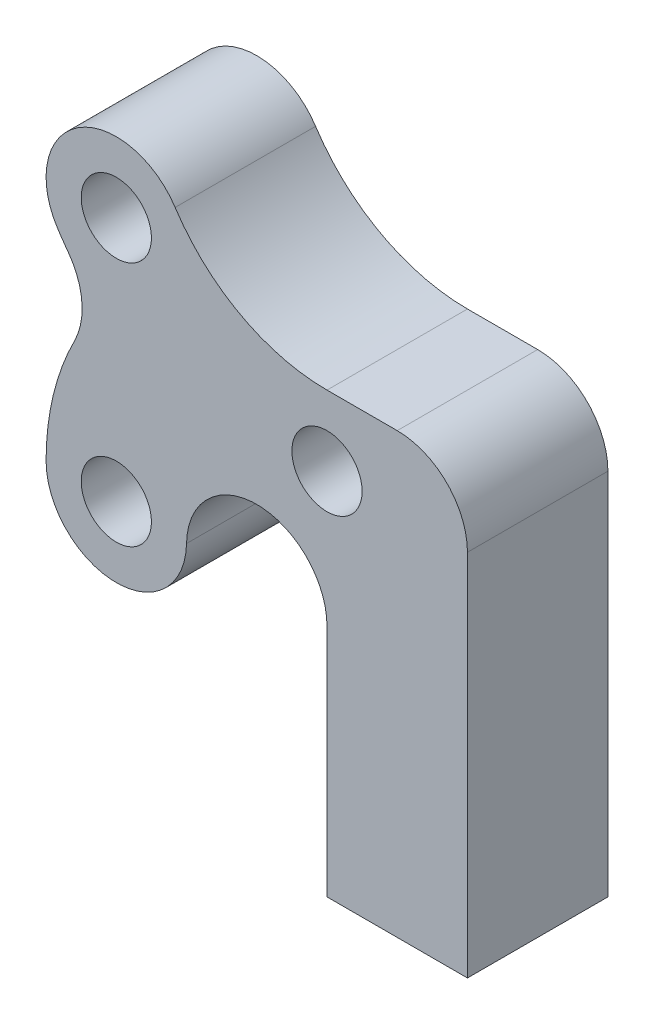
ISO-10303-21;
HEADER;
FILE_DESCRIPTION(('STEP AP214'),'2;1');
FILE_NAME('part.step','',(''),(''),'','','');
FILE_SCHEMA(('AUTOMOTIVE_DESIGN { 1 0 10303 214 1 1 1 1 }'));
ENDSEC;
DATA;
#1=APPLICATION_CONTEXT('core data for automotive mechanical design processes');
#2=APPLICATION_PROTOCOL_DEFINITION('international standard','automotive_design',2000,#1);
#3=PRODUCT_CONTEXT('',#1,'mechanical');
#4=PRODUCT('Part','Part','',(#3));
#5=PRODUCT_RELATED_PRODUCT_CATEGORY('part','',(#4));
#6=PRODUCT_DEFINITION_FORMATION('','',#4);
#7=PRODUCT_DEFINITION_CONTEXT('part definition',#1,'design');
#8=PRODUCT_DEFINITION('design','',#6,#7);
#9=PRODUCT_DEFINITION_SHAPE('','',#8);
#10=(LENGTH_UNIT() NAMED_UNIT(*) SI_UNIT(.MILLI.,.METRE.));
#11=(NAMED_UNIT(*) PLANE_ANGLE_UNIT() SI_UNIT($,.RADIAN.));
#12=(NAMED_UNIT(*) SI_UNIT($,.STERADIAN.) SOLID_ANGLE_UNIT());
#13=UNCERTAINTY_MEASURE_WITH_UNIT(LENGTH_MEASURE(1.E-05),#10,'distance_accuracy_value','');
#14=(GEOMETRIC_REPRESENTATION_CONTEXT(3) GLOBAL_UNCERTAINTY_ASSIGNED_CONTEXT((#13)) GLOBAL_UNIT_ASSIGNED_CONTEXT((#10,
#11,#12)) REPRESENTATION_CONTEXT('',''));
#15=CARTESIAN_POINT('',(0.,0.,0.));
#16=DIRECTION('',(0.,0.,1.));
#17=DIRECTION('',(1.,0.,0.));
#18=AXIS2_PLACEMENT_3D('',#15,#16,#17);
#19=CARTESIAN_POINT('',(5.63980747253201,-9.22937471019449,8.));
#20=DIRECTION('',(0.,0.,-1.));
#21=DIRECTION('',(-1.,0.,0.));
#22=AXIS2_PLACEMENT_3D('',#19,#20,#21);
#23=PLANE('',#22);
#24=DIRECTION('',(0.,1.,0.));
#25=VECTOR('',#24,1.);
#26=CARTESIAN_POINT('',(14.8236720319781,-22.7293747101943,8.));
#27=LINE('',#26,#25);
#28=CARTESIAN_POINT('',(14.8236720319781,-22.7293747101943,8.));
#29=VERTEX_POINT('',#28);
#30=CARTESIAN_POINT('',(14.8236720319781,-1.72937471019429,8.));
#31=VERTEX_POINT('',#30);
#32=EDGE_CURVE('E274',#29,#31,#27,.T.);
#33=ORIENTED_EDGE('',*,*,#32,.T.);
#34=CARTESIAN_POINT('',(10.8236720319781,-1.72937471019429,8.));
#35=DIRECTION('',(0.,0.,-1.));
#36=DIRECTION('',(-1.,0.,0.));
#37=AXIS2_PLACEMENT_3D('',#34,#35,#36);
#38=CIRCLE('',#37,4.);
#39=CARTESIAN_POINT('',(10.8236720319781,2.27062528980571,8.));
#40=VERTEX_POINT('',#39);
#41=EDGE_CURVE('E334',#31,#40,#38,.F.);
#42=ORIENTED_EDGE('',*,*,#41,.T.);
#43=DIRECTION('',(-1.,0.,0.));
#44=VECTOR('',#43,1.);
#45=CARTESIAN_POINT('',(14.8236720319781,2.27062528980571,8.));
#46=LINE('',#45,#44);
#47=CARTESIAN_POINT('',(6.82367203197809,2.2706252898057,8.));
#48=VERTEX_POINT('',#47);
#49=EDGE_CURVE('E276',#40,#48,#46,.T.);
#50=ORIENTED_EDGE('',*,*,#49,.T.);
#51=CARTESIAN_POINT('',(6.82367203197822,12.597548366729,8.));
#52=DIRECTION('',(0.,0.,1.));
#53=DIRECTION('',(1.,0.,0.));
#54=AXIS2_PLACEMENT_3D('',#51,#52,#53);
#55=CIRCLE('',#54,10.3269230769233);
#56=CARTESIAN_POINT('',(-1.82599239755211,6.95586018913457,8.));
#57=VERTEX_POINT('',#56);
#58=EDGE_CURVE('E281',#57,#48,#55,.T.);
#59=ORIENTED_EDGE('',*,*,#58,.F.);
#60=CARTESIAN_POINT('',(-5.17632796802191,4.77062528980571,8.));
#61=DIRECTION('',(0.,0.,1.));
#62=DIRECTION('',(1.,0.,0.));
#63=AXIS2_PLACEMENT_3D('',#60,#61,#62);
#64=CIRCLE('',#63,4.);
#65=CARTESIAN_POINT('',(-8.52666353849171,2.58539039047685,8.));
#66=VERTEX_POINT('',#65);
#67=EDGE_CURVE('E284',#57,#66,#64,.T.);
#68=ORIENTED_EDGE('',*,*,#67,.T.);
#69=CARTESIAN_POINT('',(6.8236720319781,12.5975483667288,8.));
#70=DIRECTION('',(0.,0.,1.));
#71=DIRECTION('',(1.,0.,0.));
#72=AXIS2_PLACEMENT_3D('',#69,#70,#71);
#73=CIRCLE('',#72,18.3269230769231);
#74=CARTESIAN_POINT('',(-7.90829225974873,1.69592749757627,8.));
#75=VERTEX_POINT('',#74);
#76=EDGE_CURVE('E286',#66,#75,#73,.T.);
#77=ORIENTED_EDGE('',*,*,#76,.T.);
#78=CARTESIAN_POINT('',(-11.1236632699053,-0.68343991143079,8.));
#79=DIRECTION('',(0.,0.,-1.));
#80=DIRECTION('',(-1.,0.,0.));
#81=AXIS2_PLACEMENT_3D('',#78,#79,#80);
#82=CIRCLE('',#81,4.);
#83=CARTESIAN_POINT('',(-7.5600259235653,-2.50016467423089,8.));
#84=VERTEX_POINT('',#83);
#85=EDGE_CURVE('E169',#75,#84,#82,.T.);
#86=ORIENTED_EDGE('',*,*,#85,.T.);
#87=CARTESIAN_POINT('',(5.63980747253156,-9.22937471019429,8.));
#88=DIRECTION('',(0.,0.,1.));
#89=DIRECTION('',(1.,0.,0.));
#90=AXIS2_PLACEMENT_3D('',#87,#88,#89);
#91=CIRCLE('',#90,14.8161354405535);
#92=CARTESIAN_POINT('',(-9.17632796802191,-9.22937471019429,8.));
#93=VERTEX_POINT('',#92);
#94=EDGE_CURVE('E288',#84,#93,#91,.T.);
#95=ORIENTED_EDGE('',*,*,#94,.T.);
#96=CARTESIAN_POINT('',(-5.17632796802191,-9.22937471019429,8.));
#97=DIRECTION('',(0.,0.,1.));
#98=DIRECTION('',(1.,0.,0.));
#99=AXIS2_PLACEMENT_3D('',#96,#97,#98);
#100=CIRCLE('',#99,4.);
#101=CARTESIAN_POINT('',(-1.17692786888462,-9.29864842108563,8.));
#102=VERTEX_POINT('',#101);
#103=EDGE_CURVE('E290',#93,#102,#100,.T.);
#104=ORIENTED_EDGE('',*,*,#103,.T.);
#105=CARTESIAN_POINT('',(2.82247223025266,-9.36792213197697,8.));
#106=DIRECTION('',(0.,0.,-1.));
#107=DIRECTION('',(-1.,0.,0.));
#108=AXIS2_PLACEMENT_3D('',#105,#106,#107);
#109=CIRCLE('',#108,4.);
#110=CARTESIAN_POINT('',(3.53931078215524,-5.43267849396595,8.));
#111=VERTEX_POINT('',#110);
#112=EDGE_CURVE('E354',#102,#111,#109,.T.);
#113=ORIENTED_EDGE('',*,*,#112,.T.);
#114=CARTESIAN_POINT('',(6.82367203197809,12.5975483667288,8.));
#115=DIRECTION('',(0.,0.,1.));
#116=DIRECTION('',(1.,0.,0.));
#117=AXIS2_PLACEMENT_3D('',#114,#115,#116);
#118=CIRCLE('',#117,18.3269230769231);
#119=CARTESIAN_POINT('',(3.54029563232262,-5.43285786512415,8.));
#120=VERTEX_POINT('',#119);
#121=EDGE_CURVE('E259',#111,#120,#118,.T.);
#122=ORIENTED_EDGE('',*,*,#121,.T.);
#123=CARTESIAN_POINT('',(2.82367203197809,-9.36814065234914,8.));
#124=DIRECTION('',(0.,0.,-1.));
#125=DIRECTION('',(-1.,0.,0.));
#126=AXIS2_PLACEMENT_3D('',#123,#124,#125);
#127=CIRCLE('',#126,4.);
#128=CARTESIAN_POINT('',(6.82367203197809,-9.36814065234914,8.));
#129=VERTEX_POINT('',#128);
#130=EDGE_CURVE('E12',#120,#129,#127,.T.);
#131=ORIENTED_EDGE('',*,*,#130,.T.);
#132=DIRECTION('',(0.,-1.,0.));
#133=VECTOR('',#132,1.);
#134=CARTESIAN_POINT('',(6.8236720319781,-5.7293747101943,8.));
#135=LINE('',#134,#133);
#136=CARTESIAN_POINT('',(6.82367203197809,-22.7293747101943,8.));
#137=VERTEX_POINT('',#136);
#138=EDGE_CURVE('E248',#129,#137,#135,.T.);
#139=ORIENTED_EDGE('',*,*,#138,.T.);
#140=DIRECTION('',(-1.,0.,0.));
#141=VECTOR('',#140,1.);
#142=CARTESIAN_POINT('',(14.8236720319781,-22.7293747101943,8.));
#143=LINE('',#142,#141);
#144=EDGE_CURVE('E253',#29,#137,#143,.T.);
#145=ORIENTED_EDGE('',*,*,#144,.F.);
#146=EDGE_LOOP('',(#33,#42,#50,#59,#68,#77,#86,#95,#104,#113,#122,#131,#139,#145));
#147=FACE_BOUND('',#146,.T.);
#148=CARTESIAN_POINT('',(-5.17632796802191,-9.22937471019429,8.));
#149=DIRECTION('',(0.,0.,1.));
#150=DIRECTION('',(1.,0.,0.));
#151=AXIS2_PLACEMENT_3D('',#148,#149,#150);
#152=CIRCLE('',#151,2.);
#153=CARTESIAN_POINT('',(-3.17632796802191,-9.22937471019429,8.));
#154=VERTEX_POINT('',#153);
#155=EDGE_CURVE('E296',#154,#154,#152,.T.);
#156=ORIENTED_EDGE('',*,*,#155,.F.);
#157=EDGE_LOOP('',(#156));
#158=FACE_BOUND('',#157,.T.);
#159=CARTESIAN_POINT('',(6.82367203197809,-1.72937471019429,8.));
#160=DIRECTION('',(0.,0.,1.));
#161=DIRECTION('',(1.,0.,0.));
#162=AXIS2_PLACEMENT_3D('',#159,#160,#161);
#163=CIRCLE('',#162,2.);
#164=CARTESIAN_POINT('',(8.82367203197809,-1.72937471019429,8.));
#165=VERTEX_POINT('',#164);
#166=EDGE_CURVE('E438',#165,#165,#163,.T.);
#167=ORIENTED_EDGE('',*,*,#166,.F.);
#168=EDGE_LOOP('',(#167));
#169=FACE_BOUND('',#168,.T.);
#170=CARTESIAN_POINT('',(-5.17632796802191,4.77062528980571,8.));
#171=DIRECTION('',(0.,0.,1.));
#172=DIRECTION('',(1.,0.,0.));
#173=AXIS2_PLACEMENT_3D('',#170,#171,#172);
#174=CIRCLE('',#173,2.);
#175=CARTESIAN_POINT('',(-3.17632796802191,4.77062528980571,8.));
#176=VERTEX_POINT('',#175);
#177=EDGE_CURVE('E444',#176,#176,#174,.T.);
#178=ORIENTED_EDGE('',*,*,#177,.F.);
#179=EDGE_LOOP('',(#178));
#180=FACE_BOUND('',#179,.T.);
#181=ADVANCED_FACE('F146',(#147,#158,#169,#180),#23,.F.);
#182=CARTESIAN_POINT('',(5.63980747253201,-9.22937471019449,0.));
#183=DIRECTION('',(0.,0.,-1.));
#184=DIRECTION('',(-1.,0.,0.));
#185=AXIS2_PLACEMENT_3D('',#182,#183,#184);
#186=PLANE('',#185);
#187=CARTESIAN_POINT('',(6.82367203197809,-1.72937471019429,0.));
#188=DIRECTION('',(0.,0.,1.));
#189=DIRECTION('',(1.,0.,0.));
#190=AXIS2_PLACEMENT_3D('',#187,#188,#189);
#191=CIRCLE('',#190,2.);
#192=CARTESIAN_POINT('',(8.82367203197809,-1.72937471019429,0.));
#193=VERTEX_POINT('',#192);
#194=EDGE_CURVE('E441',#193,#193,#191,.T.);
#195=ORIENTED_EDGE('',*,*,#194,.T.);
#196=EDGE_LOOP('',(#195));
#197=FACE_BOUND('',#196,.T.);
#198=DIRECTION('',(-1.,0.,0.));
#199=VECTOR('',#198,1.);
#200=CARTESIAN_POINT('',(14.8236720319781,2.27062528980571,0.));
#201=LINE('',#200,#199);
#202=CARTESIAN_POINT('',(10.8236720319781,2.27062528980571,0.));
#203=VERTEX_POINT('',#202);
#204=CARTESIAN_POINT('',(6.82367203197809,2.2706252898057,0.));
#205=VERTEX_POINT('',#204);
#206=EDGE_CURVE('E303',#203,#205,#201,.T.);
#207=ORIENTED_EDGE('',*,*,#206,.F.);
#208=CARTESIAN_POINT('',(10.8236720319781,-1.72937471019429,0.));
#209=DIRECTION('',(0.,0.,-1.));
#210=DIRECTION('',(-1.,0.,0.));
#211=AXIS2_PLACEMENT_3D('',#208,#209,#210);
#212=CIRCLE('',#211,4.);
#213=CARTESIAN_POINT('',(14.8236720319781,-1.72937471019429,0.));
#214=VERTEX_POINT('',#213);
#215=EDGE_CURVE('E330',#203,#214,#212,.T.);
#216=ORIENTED_EDGE('',*,*,#215,.T.);
#217=DIRECTION('',(0.,1.,0.));
#218=VECTOR('',#217,1.);
#219=CARTESIAN_POINT('',(14.8236720319781,-22.7293747101943,0.));
#220=LINE('',#219,#218);
#221=CARTESIAN_POINT('',(14.8236720319781,-22.7293747101943,0.));
#222=VERTEX_POINT('',#221);
#223=EDGE_CURVE('E300',#222,#214,#220,.T.);
#224=ORIENTED_EDGE('',*,*,#223,.F.);
#225=DIRECTION('',(-1.,0.,0.));
#226=VECTOR('',#225,1.);
#227=CARTESIAN_POINT('',(14.8236720319781,-22.7293747101943,0.));
#228=LINE('',#227,#226);
#229=CARTESIAN_POINT('',(6.82367203197809,-22.7293747101943,0.));
#230=VERTEX_POINT('',#229);
#231=EDGE_CURVE('E298',#222,#230,#228,.T.);
#232=ORIENTED_EDGE('',*,*,#231,.T.);
#233=DIRECTION('',(0.,-1.,0.));
#234=VECTOR('',#233,1.);
#235=CARTESIAN_POINT('',(6.8236720319781,-5.7293747101943,0.));
#236=LINE('',#235,#234);
#237=CARTESIAN_POINT('',(6.82367203197809,-9.36814065234914,0.));
#238=VERTEX_POINT('',#237);
#239=EDGE_CURVE('E265',#238,#230,#236,.T.);
#240=ORIENTED_EDGE('',*,*,#239,.F.);
#241=CARTESIAN_POINT('',(2.82367203197809,-9.36814065234914,0.));
#242=DIRECTION('',(0.,0.,-1.));
#243=DIRECTION('',(-1.,0.,0.));
#244=AXIS2_PLACEMENT_3D('',#241,#242,#243);
#245=CIRCLE('',#244,4.);
#246=CARTESIAN_POINT('',(3.54029563232262,-5.43285786512415,0.));
#247=VERTEX_POINT('',#246);
#248=EDGE_CURVE('E154',#238,#247,#245,.F.);
#249=ORIENTED_EDGE('',*,*,#248,.T.);
#250=CARTESIAN_POINT('',(6.82367203197809,12.5975483667288,0.));
#251=DIRECTION('',(0.,0.,1.));
#252=DIRECTION('',(1.,0.,0.));
#253=AXIS2_PLACEMENT_3D('',#250,#251,#252);
#254=CIRCLE('',#253,18.3269230769231);
#255=CARTESIAN_POINT('',(3.53931078215524,-5.43267849396595,0.));
#256=VERTEX_POINT('',#255);
#257=EDGE_CURVE('E293',#256,#247,#254,.T.);
#258=ORIENTED_EDGE('',*,*,#257,.F.);
#259=CARTESIAN_POINT('',(2.82247223025266,-9.36792213197697,0.));
#260=DIRECTION('',(0.,0.,-1.));
#261=DIRECTION('',(-1.,0.,0.));
#262=AXIS2_PLACEMENT_3D('',#259,#260,#261);
#263=CIRCLE('',#262,4.);
#264=CARTESIAN_POINT('',(-1.17692786888462,-9.29864842108563,0.));
#265=VERTEX_POINT('',#264);
#266=EDGE_CURVE('E352',#256,#265,#263,.F.);
#267=ORIENTED_EDGE('',*,*,#266,.T.);
#268=CARTESIAN_POINT('',(-5.17632796802191,-9.22937471019429,0.));
#269=DIRECTION('',(0.,0.,1.));
#270=DIRECTION('',(1.,0.,0.));
#271=AXIS2_PLACEMENT_3D('',#268,#269,#270);
#272=CIRCLE('',#271,4.);
#273=CARTESIAN_POINT('',(-9.17632796802191,-9.22937471019429,0.));
#274=VERTEX_POINT('',#273);
#275=EDGE_CURVE('E315',#274,#265,#272,.T.);
#276=ORIENTED_EDGE('',*,*,#275,.F.);
#277=CARTESIAN_POINT('',(5.63980747253156,-9.22937471019429,0.));
#278=DIRECTION('',(0.,0.,1.));
#279=DIRECTION('',(1.,0.,0.));
#280=AXIS2_PLACEMENT_3D('',#277,#278,#279);
#281=CIRCLE('',#280,14.8161354405535);
#282=CARTESIAN_POINT('',(-7.5600259235653,-2.50016467423089,0.));
#283=VERTEX_POINT('',#282);
#284=EDGE_CURVE('E313',#283,#274,#281,.T.);
#285=ORIENTED_EDGE('',*,*,#284,.F.);
#286=CARTESIAN_POINT('',(-11.1236632699053,-0.68343991143079,0.));
#287=DIRECTION('',(0.,0.,-1.));
#288=DIRECTION('',(-1.,0.,0.));
#289=AXIS2_PLACEMENT_3D('',#286,#287,#288);
#290=CIRCLE('',#289,4.);
#291=CARTESIAN_POINT('',(-7.90829225974873,1.69592749757627,0.));
#292=VERTEX_POINT('',#291);
#293=EDGE_CURVE('E349',#283,#292,#290,.F.);
#294=ORIENTED_EDGE('',*,*,#293,.T.);
#295=CARTESIAN_POINT('',(6.8236720319781,12.5975483667288,0.));
#296=DIRECTION('',(0.,0.,1.));
#297=DIRECTION('',(1.,0.,0.));
#298=AXIS2_PLACEMENT_3D('',#295,#296,#297);
#299=CIRCLE('',#298,18.3269230769231);
#300=CARTESIAN_POINT('',(-8.52666353849171,2.58539039047685,0.));
#301=VERTEX_POINT('',#300);
#302=EDGE_CURVE('E310',#301,#292,#299,.T.);
#303=ORIENTED_EDGE('',*,*,#302,.F.);
#304=CARTESIAN_POINT('',(-5.17632796802191,4.77062528980571,0.));
#305=DIRECTION('',(0.,0.,1.));
#306=DIRECTION('',(1.,0.,0.));
#307=AXIS2_PLACEMENT_3D('',#304,#305,#306);
#308=CIRCLE('',#307,4.);
#309=CARTESIAN_POINT('',(-1.82599239755211,6.95586018913457,0.));
#310=VERTEX_POINT('',#309);
#311=EDGE_CURVE('E308',#310,#301,#308,.T.);
#312=ORIENTED_EDGE('',*,*,#311,.F.);
#313=CARTESIAN_POINT('',(6.82367203197822,12.597548366729,0.));
#314=DIRECTION('',(0.,0.,1.));
#315=DIRECTION('',(1.,0.,0.));
#316=AXIS2_PLACEMENT_3D('',#313,#314,#315);
#317=CIRCLE('',#316,10.3269230769233);
#318=EDGE_CURVE('E305',#310,#205,#317,.T.);
#319=ORIENTED_EDGE('',*,*,#318,.T.);
#320=EDGE_LOOP('',(#207,#216,#224,#232,#240,#249,#258,#267,#276,#285,#294,#303,#312,#319));
#321=FACE_BOUND('',#320,.T.);
#322=CARTESIAN_POINT('',(-5.17632796802191,-9.22937471019429,0.));
#323=DIRECTION('',(0.,0.,1.));
#324=DIRECTION('',(1.,0.,0.));
#325=AXIS2_PLACEMENT_3D('',#322,#323,#324);
#326=CIRCLE('',#325,2.);
#327=CARTESIAN_POINT('',(-3.17632796802191,-9.22937471019429,0.));
#328=VERTEX_POINT('',#327);
#329=EDGE_CURVE('E435',#328,#328,#326,.T.);
#330=ORIENTED_EDGE('',*,*,#329,.T.);
#331=EDGE_LOOP('',(#330));
#332=FACE_BOUND('',#331,.T.);
#333=CARTESIAN_POINT('',(-5.17632796802191,4.77062528980571,0.));
#334=DIRECTION('',(0.,0.,1.));
#335=DIRECTION('',(1.,0.,0.));
#336=AXIS2_PLACEMENT_3D('',#333,#334,#335);
#337=CIRCLE('',#336,2.);
#338=CARTESIAN_POINT('',(-3.17632796802191,4.77062528980571,0.));
#339=VERTEX_POINT('',#338);
#340=EDGE_CURVE('E447',#339,#339,#337,.T.);
#341=ORIENTED_EDGE('',*,*,#340,.T.);
#342=EDGE_LOOP('',(#341));
#343=FACE_BOUND('',#342,.T.);
#344=ADVANCED_FACE('F358',(#197,#321,#332,#343),#186,.T.);
#345=CARTESIAN_POINT('',(6.82367203197809,12.5975483667288,8.));
#346=DIRECTION('',(0.,0.,-1.));
#347=DIRECTION('',(-1.,0.,0.));
#348=AXIS2_PLACEMENT_3D('',#345,#346,#347);
#349=CYLINDRICAL_SURFACE('',#348,18.3269230769231);
#350=ORIENTED_EDGE('',*,*,#121,.F.);
#351=DIRECTION('',(0.,0.,-1.));
#352=VECTOR('',#351,1.);
#353=CARTESIAN_POINT('',(3.53931078215524,-5.43267849396595,8.));
#354=LINE('',#353,#352);
#355=EDGE_CURVE('E343',#111,#256,#354,.T.);
#356=ORIENTED_EDGE('',*,*,#355,.T.);
#357=ORIENTED_EDGE('',*,*,#257,.T.);
#358=DIRECTION('',(0.,0.,-1.));
#359=VECTOR('',#358,1.);
#360=CARTESIAN_POINT('',(3.54029563232262,-5.43285786512415,8.));
#361=LINE('',#360,#359);
#362=EDGE_CURVE('E341',#247,#120,#361,.F.);
#363=ORIENTED_EDGE('',*,*,#362,.T.);
#364=EDGE_LOOP('',(#350,#356,#357,#363));
#365=FACE_BOUND('',#364,.T.);
#366=ADVANCED_FACE('F364',(#365),#349,.T.);
#367=CARTESIAN_POINT('',(6.8236720319781,-5.7293747101943,8.));
#368=DIRECTION('',(1.,0.,0.));
#369=DIRECTION('',(0.,1.,0.));
#370=AXIS2_PLACEMENT_3D('',#367,#368,#369);
#371=PLANE('',#370);
#372=ORIENTED_EDGE('',*,*,#138,.F.);
#373=DIRECTION('',(0.,0.,1.));
#374=VECTOR('',#373,1.);
#375=CARTESIAN_POINT('',(6.82367203197809,-9.36814065234914,0.));
#376=LINE('',#375,#374);
#377=EDGE_CURVE('E347',#129,#238,#376,.F.);
#378=ORIENTED_EDGE('',*,*,#377,.T.);
#379=ORIENTED_EDGE('',*,*,#239,.T.);
#380=DIRECTION('',(0.,0.,-1.));
#381=VECTOR('',#380,1.);
#382=CARTESIAN_POINT('',(6.82367203197809,-22.7293747101943,8.));
#383=LINE('',#382,#381);
#384=EDGE_CURVE('E262',#137,#230,#383,.T.);
#385=ORIENTED_EDGE('',*,*,#384,.F.);
#386=EDGE_LOOP('',(#372,#378,#379,#385));
#387=FACE_BOUND('',#386,.T.);
#388=ADVANCED_FACE('F263',(#387),#371,.F.);
#389=CARTESIAN_POINT('',(14.8236720319781,-22.7293747101943,8.));
#390=DIRECTION('',(0.,-1.,0.));
#391=DIRECTION('',(1.,0.,0.));
#392=AXIS2_PLACEMENT_3D('',#389,#390,#391);
#393=PLANE('',#392);
#394=CARTESIAN_POINT('',(10.8236720319781,-22.7293747101943,4.));
#395=DIRECTION('',(0.,-1.,0.));
#396=DIRECTION('',(0.,0.,-1.));
#397=AXIS2_PLACEMENT_3D('',#394,#395,#396);
#398=CIRCLE('',#397,2.);
#399=CARTESIAN_POINT('',(10.8236720319781,-22.7293747101943,2.));
#400=VERTEX_POINT('',#399);
#401=EDGE_CURVE('E453',#400,#400,#398,.T.);
#402=ORIENTED_EDGE('',*,*,#401,.F.);
#403=EDGE_LOOP('',(#402));
#404=FACE_BOUND('',#403,.T.);
#405=ORIENTED_EDGE('',*,*,#231,.F.);
#406=DIRECTION('',(0.,0.,-1.));
#407=VECTOR('',#406,1.);
#408=CARTESIAN_POINT('',(14.8236720319781,-22.7293747101943,8.));
#409=LINE('',#408,#407);
#410=EDGE_CURVE('E270',#29,#222,#409,.T.);
#411=ORIENTED_EDGE('',*,*,#410,.F.);
#412=ORIENTED_EDGE('',*,*,#144,.T.);
#413=ORIENTED_EDGE('',*,*,#384,.T.);
#414=EDGE_LOOP('',(#405,#411,#412,#413));
#415=FACE_BOUND('',#414,.T.);
#416=ADVANCED_FACE('F272',(#404,#415),#393,.T.);
#417=CARTESIAN_POINT('',(14.8236720319781,-22.7293747101943,8.));
#418=DIRECTION('',(-1.,0.,0.));
#419=DIRECTION('',(0.,-1.,0.));
#420=AXIS2_PLACEMENT_3D('',#417,#418,#419);
#421=PLANE('',#420);
#422=ORIENTED_EDGE('',*,*,#223,.T.);
#423=DIRECTION('',(0.,0.,-1.));
#424=VECTOR('',#423,1.);
#425=CARTESIAN_POINT('',(14.8236720319781,-1.72937471019429,8.));
#426=LINE('',#425,#424);
#427=EDGE_CURVE('E332',#214,#31,#426,.F.);
#428=ORIENTED_EDGE('',*,*,#427,.T.);
#429=ORIENTED_EDGE('',*,*,#32,.F.);
#430=ORIENTED_EDGE('',*,*,#410,.T.);
#431=EDGE_LOOP('',(#422,#428,#429,#430));
#432=FACE_BOUND('',#431,.T.);
#433=ADVANCED_FACE('F406',(#432),#421,.F.);
#434=CARTESIAN_POINT('',(14.8236720319781,2.27062528980571,8.));
#435=DIRECTION('',(0.,-1.,0.));
#436=DIRECTION('',(1.,0.,0.));
#437=AXIS2_PLACEMENT_3D('',#434,#435,#436);
#438=PLANE('',#437);
#439=ORIENTED_EDGE('',*,*,#49,.F.);
#440=DIRECTION('',(0.,0.,-1.));
#441=VECTOR('',#440,1.);
#442=CARTESIAN_POINT('',(10.8236720319781,2.27062528980571,8.));
#443=LINE('',#442,#441);
#444=EDGE_CURVE('E269',#40,#203,#443,.T.);
#445=ORIENTED_EDGE('',*,*,#444,.T.);
#446=ORIENTED_EDGE('',*,*,#206,.T.);
#447=DIRECTION('',(0.,0.,-1.));
#448=VECTOR('',#447,1.);
#449=CARTESIAN_POINT('',(6.82367203197809,2.2706252898057,8.));
#450=LINE('',#449,#448);
#451=EDGE_CURVE('E324',#48,#205,#450,.T.);
#452=ORIENTED_EDGE('',*,*,#451,.F.);
#453=EDGE_LOOP('',(#439,#445,#446,#452));
#454=FACE_BOUND('',#453,.T.);
#455=ADVANCED_FACE('F402',(#454),#438,.F.);
#456=CARTESIAN_POINT('',(6.82367203197822,12.597548366729,8.));
#457=DIRECTION('',(0.,0.,-1.));
#458=DIRECTION('',(-1.,0.,0.));
#459=AXIS2_PLACEMENT_3D('',#456,#457,#458);
#460=CYLINDRICAL_SURFACE('',#459,10.3269230769233);
#461=ORIENTED_EDGE('',*,*,#318,.F.);
#462=DIRECTION('',(0.,0.,-1.));
#463=VECTOR('',#462,1.);
#464=CARTESIAN_POINT('',(-1.82599239755211,6.95586018913457,8.));
#465=LINE('',#464,#463);
#466=EDGE_CURVE('E322',#57,#310,#465,.T.);
#467=ORIENTED_EDGE('',*,*,#466,.F.);
#468=ORIENTED_EDGE('',*,*,#58,.T.);
#469=ORIENTED_EDGE('',*,*,#451,.T.);
#470=EDGE_LOOP('',(#461,#467,#468,#469));
#471=FACE_BOUND('',#470,.T.);
#472=ADVANCED_FACE('F398',(#471),#460,.F.);
#473=CARTESIAN_POINT('',(-5.17632796802191,4.77062528980571,8.));
#474=DIRECTION('',(0.,0.,-1.));
#475=DIRECTION('',(-1.,0.,0.));
#476=AXIS2_PLACEMENT_3D('',#473,#474,#475);
#477=CYLINDRICAL_SURFACE('',#476,4.);
#478=ORIENTED_EDGE('',*,*,#311,.T.);
#479=DIRECTION('',(0.,0.,-1.));
#480=VECTOR('',#479,1.);
#481=CARTESIAN_POINT('',(-8.52666353849171,2.58539039047685,8.));
#482=LINE('',#481,#480);
#483=EDGE_CURVE('E319',#66,#301,#482,.T.);
#484=ORIENTED_EDGE('',*,*,#483,.F.);
#485=ORIENTED_EDGE('',*,*,#67,.F.);
#486=ORIENTED_EDGE('',*,*,#466,.T.);
#487=EDGE_LOOP('',(#478,#484,#485,#486));
#488=FACE_BOUND('',#487,.T.);
#489=ADVANCED_FACE('F394',(#488),#477,.T.);
#490=CARTESIAN_POINT('',(6.8236720319781,12.5975483667288,8.));
#491=DIRECTION('',(0.,0.,-1.));
#492=DIRECTION('',(-1.,0.,0.));
#493=AXIS2_PLACEMENT_3D('',#490,#491,#492);
#494=CYLINDRICAL_SURFACE('',#493,18.3269230769231);
#495=ORIENTED_EDGE('',*,*,#302,.T.);
#496=DIRECTION('',(0.,0.,-1.));
#497=VECTOR('',#496,1.);
#498=CARTESIAN_POINT('',(-7.90829225974873,1.69592749757627,8.));
#499=LINE('',#498,#497);
#500=EDGE_CURVE('E339',#292,#75,#499,.F.);
#501=ORIENTED_EDGE('',*,*,#500,.T.);
#502=ORIENTED_EDGE('',*,*,#76,.F.);
#503=ORIENTED_EDGE('',*,*,#483,.T.);
#504=EDGE_LOOP('',(#495,#501,#502,#503));
#505=FACE_BOUND('',#504,.T.);
#506=ADVANCED_FACE('F390',(#505),#494,.T.);
#507=CARTESIAN_POINT('',(5.63980747253156,-9.22937471019429,8.));
#508=DIRECTION('',(0.,0.,-1.));
#509=DIRECTION('',(-1.,0.,0.));
#510=AXIS2_PLACEMENT_3D('',#507,#508,#509);
#511=CYLINDRICAL_SURFACE('',#510,14.8161354405535);
#512=ORIENTED_EDGE('',*,*,#94,.F.);
#513=DIRECTION('',(0.,0.,-1.));
#514=VECTOR('',#513,1.);
#515=CARTESIAN_POINT('',(-7.5600259235653,-2.50016467423089,8.));
#516=LINE('',#515,#514);
#517=EDGE_CURVE('E336',#84,#283,#516,.T.);
#518=ORIENTED_EDGE('',*,*,#517,.T.);
#519=ORIENTED_EDGE('',*,*,#284,.T.);
#520=DIRECTION('',(0.,0.,-1.));
#521=VECTOR('',#520,1.);
#522=CARTESIAN_POINT('',(-9.17632796802191,-9.22937471019429,8.));
#523=LINE('',#522,#521);
#524=EDGE_CURVE('E292',#93,#274,#523,.T.);
#525=ORIENTED_EDGE('',*,*,#524,.F.);
#526=EDGE_LOOP('',(#512,#518,#519,#525));
#527=FACE_BOUND('',#526,.T.);
#528=ADVANCED_FACE('F387',(#527),#511,.T.);
#529=CARTESIAN_POINT('',(-5.17632796802191,-9.22937471019429,8.));
#530=DIRECTION('',(0.,0.,-1.));
#531=DIRECTION('',(-1.,0.,0.));
#532=AXIS2_PLACEMENT_3D('',#529,#530,#531);
#533=CYLINDRICAL_SURFACE('',#532,4.);
#534=ORIENTED_EDGE('',*,*,#275,.T.);
#535=DIRECTION('',(0.,0.,-1.));
#536=VECTOR('',#535,1.);
#537=CARTESIAN_POINT('',(-1.17692786888462,-9.29864842108563,8.));
#538=LINE('',#537,#536);
#539=EDGE_CURVE('E161',#265,#102,#538,.F.);
#540=ORIENTED_EDGE('',*,*,#539,.T.);
#541=ORIENTED_EDGE('',*,*,#103,.F.);
#542=ORIENTED_EDGE('',*,*,#524,.T.);
#543=EDGE_LOOP('',(#534,#540,#541,#542));
#544=FACE_BOUND('',#543,.T.);
#545=ADVANCED_FACE('F384',(#544),#533,.T.);
#546=CARTESIAN_POINT('',(-5.17632796802191,-9.22937471019429,8.));
#547=DIRECTION('',(0.,0.,-1.));
#548=DIRECTION('',(-1.,0.,0.));
#549=AXIS2_PLACEMENT_3D('',#546,#547,#548);
#550=CYLINDRICAL_SURFACE('',#549,2.);
#551=ORIENTED_EDGE('',*,*,#155,.T.);
#552=EDGE_LOOP('',(#551));
#553=FACE_BOUND('',#552,.T.);
#554=ORIENTED_EDGE('',*,*,#329,.F.);
#555=EDGE_LOOP('',(#554));
#556=FACE_BOUND('',#555,.T.);
#557=ADVANCED_FACE('F381',(#553,#556),#550,.F.);
#558=CARTESIAN_POINT('',(6.82367203197809,-1.72937471019429,8.));
#559=DIRECTION('',(0.,0.,-1.));
#560=DIRECTION('',(-1.,0.,0.));
#561=AXIS2_PLACEMENT_3D('',#558,#559,#560);
#562=CYLINDRICAL_SURFACE('',#561,2.);
#563=ORIENTED_EDGE('',*,*,#166,.T.);
#564=EDGE_LOOP('',(#563));
#565=FACE_BOUND('',#564,.T.);
#566=ORIENTED_EDGE('',*,*,#194,.F.);
#567=EDGE_LOOP('',(#566));
#568=FACE_BOUND('',#567,.T.);
#569=ADVANCED_FACE('F471',(#565,#568),#562,.F.);
#570=CARTESIAN_POINT('',(-5.17632796802191,4.77062528980571,8.));
#571=DIRECTION('',(0.,0.,-1.));
#572=DIRECTION('',(-1.,0.,0.));
#573=AXIS2_PLACEMENT_3D('',#570,#571,#572);
#574=CYLINDRICAL_SURFACE('',#573,2.);
#575=ORIENTED_EDGE('',*,*,#177,.T.);
#576=EDGE_LOOP('',(#575));
#577=FACE_BOUND('',#576,.T.);
#578=ORIENTED_EDGE('',*,*,#340,.F.);
#579=EDGE_LOOP('',(#578));
#580=FACE_BOUND('',#579,.T.);
#581=ADVANCED_FACE('F463',(#577,#580),#574,.F.);
#582=CARTESIAN_POINT('',(10.8236720319781,-2.72937471019431,4.));
#583=DIRECTION('',(0.,-1.,0.));
#584=DIRECTION('',(0.,0.,-1.));
#585=AXIS2_PLACEMENT_3D('',#582,#583,#584);
#586=CYLINDRICAL_SURFACE('',#585,2.);
#587=CARTESIAN_POINT('',(10.8236720319781,-2.72937471019431,4.));
#588=DIRECTION('',(0.,-1.,0.));
#589=DIRECTION('',(0.,0.,-1.));
#590=AXIS2_PLACEMENT_3D('',#587,#588,#589);
#591=CIRCLE('',#590,2.);
#592=CARTESIAN_POINT('',(10.8236720319781,-2.72937471019431,2.));
#593=VERTEX_POINT('',#592);
#594=EDGE_CURVE('E450',#593,#593,#591,.T.);
#595=ORIENTED_EDGE('',*,*,#594,.F.);
#596=EDGE_LOOP('',(#595));
#597=FACE_BOUND('',#596,.T.);
#598=ORIENTED_EDGE('',*,*,#401,.T.);
#599=EDGE_LOOP('',(#598));
#600=FACE_BOUND('',#599,.T.);
#601=ADVANCED_FACE('F460',(#597,#600),#586,.F.);
#602=CARTESIAN_POINT('',(10.8236720319781,-2.72937471019431,4.));
#603=DIRECTION('',(0.,-1.,0.));
#604=DIRECTION('',(0.,0.,-1.));
#605=AXIS2_PLACEMENT_3D('',#602,#603,#604);
#606=PLANE('',#605);
#607=ORIENTED_EDGE('',*,*,#594,.T.);
#608=EDGE_LOOP('',(#607));
#609=FACE_BOUND('',#608,.T.);
#610=ADVANCED_FACE('F421',(#609),#606,.T.);
#611=CARTESIAN_POINT('',(10.8236720319781,-1.72937471019429,8.));
#612=DIRECTION('',(0.,0.,-1.));
#613=DIRECTION('',(-1.,0.,0.));
#614=AXIS2_PLACEMENT_3D('',#611,#612,#613);
#615=CYLINDRICAL_SURFACE('',#614,4.);
#616=ORIENTED_EDGE('',*,*,#41,.F.);
#617=ORIENTED_EDGE('',*,*,#427,.F.);
#618=ORIENTED_EDGE('',*,*,#215,.F.);
#619=ORIENTED_EDGE('',*,*,#444,.F.);
#620=EDGE_LOOP('',(#616,#617,#618,#619));
#621=FACE_BOUND('',#620,.T.);
#622=ADVANCED_FACE('F418',(#621),#615,.T.);
#623=CARTESIAN_POINT('',(-11.1236632699053,-0.68343991143079,8.));
#624=DIRECTION('',(0.,0.,1.));
#625=DIRECTION('',(1.,0.,0.));
#626=AXIS2_PLACEMENT_3D('',#623,#624,#625);
#627=CYLINDRICAL_SURFACE('',#626,4.);
#628=ORIENTED_EDGE('',*,*,#85,.F.);
#629=ORIENTED_EDGE('',*,*,#500,.F.);
#630=ORIENTED_EDGE('',*,*,#293,.F.);
#631=ORIENTED_EDGE('',*,*,#517,.F.);
#632=EDGE_LOOP('',(#628,#629,#630,#631));
#633=FACE_BOUND('',#632,.T.);
#634=ADVANCED_FACE('F371',(#633),#627,.F.);
#635=CARTESIAN_POINT('',(2.82247223025266,-9.36792213197697,8.));
#636=DIRECTION('',(0.,0.,1.));
#637=DIRECTION('',(1.,0.,0.));
#638=AXIS2_PLACEMENT_3D('',#635,#636,#637);
#639=CYLINDRICAL_SURFACE('',#638,4.);
#640=ORIENTED_EDGE('',*,*,#112,.F.);
#641=ORIENTED_EDGE('',*,*,#539,.F.);
#642=ORIENTED_EDGE('',*,*,#266,.F.);
#643=ORIENTED_EDGE('',*,*,#355,.F.);
#644=EDGE_LOOP('',(#640,#641,#642,#643));
#645=FACE_BOUND('',#644,.T.);
#646=ADVANCED_FACE('F367',(#645),#639,.F.);
#647=CARTESIAN_POINT('',(2.82367203197809,-9.36814065234914,8.));
#648=DIRECTION('',(0.,0.,-1.));
#649=DIRECTION('',(-1.,0.,0.));
#650=AXIS2_PLACEMENT_3D('',#647,#648,#649);
#651=CYLINDRICAL_SURFACE('',#650,4.);
#652=ORIENTED_EDGE('',*,*,#130,.F.);
#653=ORIENTED_EDGE('',*,*,#362,.F.);
#654=ORIENTED_EDGE('',*,*,#248,.F.);
#655=ORIENTED_EDGE('',*,*,#377,.F.);
#656=EDGE_LOOP('',(#652,#653,#654,#655));
#657=FACE_BOUND('',#656,.T.);
#658=ADVANCED_FACE('F148',(#657),#651,.F.);
#659=CLOSED_SHELL('',(#181,#344,#366,#388,#416,#433,#455,#472,#489,#506,#528,#545,#557,#569,
#581,#601,#610,#622,#634,#646,#658));
#660=MANIFOLD_SOLID_BREP('B2',#659);
#661=ADVANCED_BREP_SHAPE_REPRESENTATION('',(#18,#660),#14);
#662=SHAPE_DEFINITION_REPRESENTATION(#9,#661);
ENDSEC;
END-ISO-10303-21;
